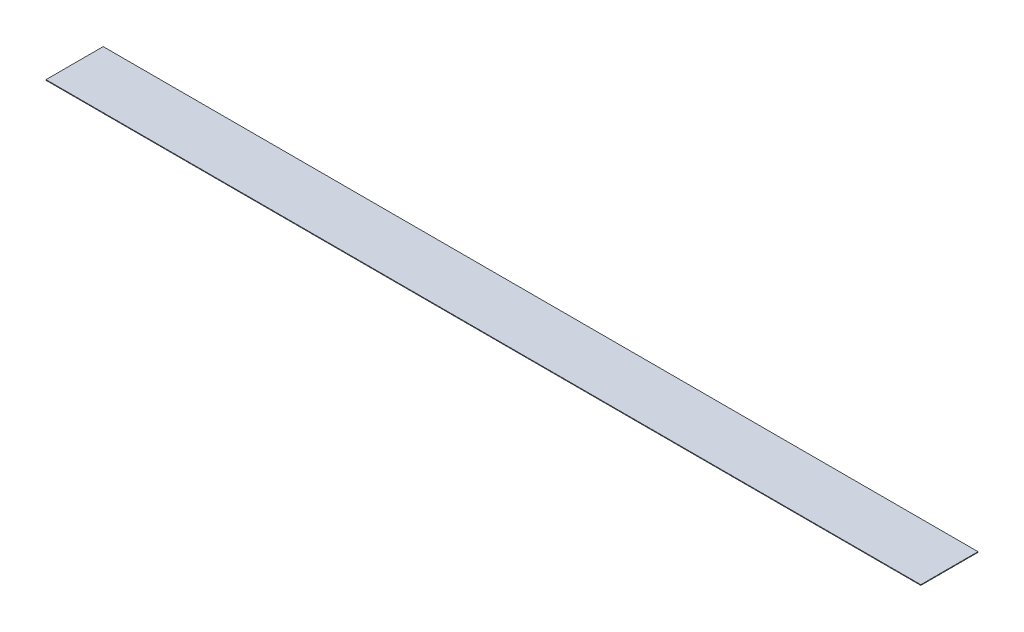
ISO-10303-21;
HEADER;
FILE_DESCRIPTION(('STEP AP214'),'2;1');
FILE_NAME('part.step','',(''),(''),'','','');
FILE_SCHEMA(('AUTOMOTIVE_DESIGN { 1 0 10303 214 1 1 1 1 }'));
ENDSEC;
DATA;
#1=APPLICATION_CONTEXT('core data for automotive mechanical design processes');
#2=APPLICATION_PROTOCOL_DEFINITION('international standard','automotive_design',2000,#1);
#3=PRODUCT_CONTEXT('',#1,'mechanical');
#4=PRODUCT('Part','Part','',(#3));
#5=PRODUCT_RELATED_PRODUCT_CATEGORY('part','',(#4));
#6=PRODUCT_DEFINITION_FORMATION('','',#4);
#7=PRODUCT_DEFINITION_CONTEXT('part definition',#1,'design');
#8=PRODUCT_DEFINITION('design','',#6,#7);
#9=PRODUCT_DEFINITION_SHAPE('','',#8);
#10=(LENGTH_UNIT() NAMED_UNIT(*) SI_UNIT(.MILLI.,.METRE.));
#11=(NAMED_UNIT(*) PLANE_ANGLE_UNIT() SI_UNIT($,.RADIAN.));
#12=(NAMED_UNIT(*) SI_UNIT($,.STERADIAN.) SOLID_ANGLE_UNIT());
#13=UNCERTAINTY_MEASURE_WITH_UNIT(LENGTH_MEASURE(1.E-05),#10,'distance_accuracy_value','');
#14=(GEOMETRIC_REPRESENTATION_CONTEXT(3) GLOBAL_UNCERTAINTY_ASSIGNED_CONTEXT((#13)) GLOBAL_UNIT_ASSIGNED_CONTEXT((#10,
#11,#12)) REPRESENTATION_CONTEXT('',''));
#15=CARTESIAN_POINT('',(0.,0.,0.));
#16=DIRECTION('',(0.,0.,1.));
#17=DIRECTION('',(1.,0.,0.));
#18=AXIS2_PLACEMENT_3D('',#15,#16,#17);
#19=CARTESIAN_POINT('',(0.,0.762,-34.78));
#20=DIRECTION('',(1.,0.,0.));
#21=DIRECTION('',(0.,0.,-1.));
#22=AXIS2_PLACEMENT_3D('',#19,#20,#21);
#23=PLANE('',#22);
#24=DIRECTION('',(0.,0.,1.));
#25=VECTOR('',#24,1.);
#26=CARTESIAN_POINT('',(0.,0.,-34.78));
#27=LINE('',#26,#25);
#28=CARTESIAN_POINT('',(0.,0.,-34.78));
#29=VERTEX_POINT('',#28);
#30=CARTESIAN_POINT('',(0.,0.,34.78));
#31=VERTEX_POINT('',#30);
#32=EDGE_CURVE('E74',#29,#31,#27,.T.);
#33=ORIENTED_EDGE('',*,*,#32,.T.);
#34=DIRECTION('',(0.,-1.,0.));
#35=VECTOR('',#34,1.);
#36=CARTESIAN_POINT('',(0.,0.762,34.78));
#37=LINE('',#36,#35);
#38=CARTESIAN_POINT('',(0.,0.762,34.78));
#39=VERTEX_POINT('',#38);
#40=EDGE_CURVE('E11',#39,#31,#37,.T.);
#41=ORIENTED_EDGE('',*,*,#40,.F.);
#42=DIRECTION('',(0.,0.,1.));
#43=VECTOR('',#42,1.);
#44=CARTESIAN_POINT('',(0.,0.762,-34.78));
#45=LINE('',#44,#43);
#46=CARTESIAN_POINT('',(0.,0.762,-34.78));
#47=VERTEX_POINT('',#46);
#48=EDGE_CURVE('E92',#47,#39,#45,.T.);
#49=ORIENTED_EDGE('',*,*,#48,.F.);
#50=DIRECTION('',(0.,-1.,0.));
#51=VECTOR('',#50,1.);
#52=CARTESIAN_POINT('',(0.,0.762,-34.78));
#53=LINE('',#52,#51);
#54=EDGE_CURVE('E86',#47,#29,#53,.T.);
#55=ORIENTED_EDGE('',*,*,#54,.T.);
#56=EDGE_LOOP('',(#33,#41,#49,#55));
#57=FACE_BOUND('',#56,.T.);
#58=ADVANCED_FACE('F30',(#57),#23,.F.);
#59=CARTESIAN_POINT('',(0.,0.762,34.78));
#60=DIRECTION('',(0.,0.,-1.));
#61=DIRECTION('',(-1.,0.,0.));
#62=AXIS2_PLACEMENT_3D('',#59,#60,#61);
#63=PLANE('',#62);
#64=DIRECTION('',(1.,0.,0.));
#65=VECTOR('',#64,1.);
#66=CARTESIAN_POINT('',(0.,0.,34.78));
#67=LINE('',#66,#65);
#68=CARTESIAN_POINT('',(1064.,0.,34.78));
#69=VERTEX_POINT('',#68);
#70=EDGE_CURVE('E70',#31,#69,#67,.T.);
#71=ORIENTED_EDGE('',*,*,#70,.T.);
#72=DIRECTION('',(0.,-1.,0.));
#73=VECTOR('',#72,1.);
#74=CARTESIAN_POINT('',(1064.,0.762,34.78));
#75=LINE('',#74,#73);
#76=CARTESIAN_POINT('',(1064.,0.762,34.78));
#77=VERTEX_POINT('',#76);
#78=EDGE_CURVE('E37',#77,#69,#75,.T.);
#79=ORIENTED_EDGE('',*,*,#78,.F.);
#80=DIRECTION('',(1.,0.,0.));
#81=VECTOR('',#80,1.);
#82=CARTESIAN_POINT('',(0.,0.762,34.78));
#83=LINE('',#82,#81);
#84=EDGE_CURVE('E82',#39,#77,#83,.T.);
#85=ORIENTED_EDGE('',*,*,#84,.F.);
#86=ORIENTED_EDGE('',*,*,#40,.T.);
#87=EDGE_LOOP('',(#71,#79,#85,#86));
#88=FACE_BOUND('',#87,.T.);
#89=ADVANCED_FACE('F81',(#88),#63,.F.);
#90=CARTESIAN_POINT('',(1064.,0.762,-34.78));
#91=DIRECTION('',(-1.,0.,0.));
#92=DIRECTION('',(0.,0.,1.));
#93=AXIS2_PLACEMENT_3D('',#90,#91,#92);
#94=PLANE('',#93);
#95=DIRECTION('',(0.,0.,-1.));
#96=VECTOR('',#95,1.);
#97=CARTESIAN_POINT('',(1064.,0.,-34.78));
#98=LINE('',#97,#96);
#99=CARTESIAN_POINT('',(1064.,0.,-34.78));
#100=VERTEX_POINT('',#99);
#101=EDGE_CURVE('E75',#69,#100,#98,.T.);
#102=ORIENTED_EDGE('',*,*,#101,.T.);
#103=DIRECTION('',(0.,-1.,0.));
#104=VECTOR('',#103,1.);
#105=CARTESIAN_POINT('',(1064.,0.762,-34.78));
#106=LINE('',#105,#104);
#107=CARTESIAN_POINT('',(1064.,0.762,-34.78));
#108=VERTEX_POINT('',#107);
#109=EDGE_CURVE('E98',#108,#100,#106,.T.);
#110=ORIENTED_EDGE('',*,*,#109,.F.);
#111=DIRECTION('',(0.,0.,-1.));
#112=VECTOR('',#111,1.);
#113=CARTESIAN_POINT('',(1064.,0.762,-34.78));
#114=LINE('',#113,#112);
#115=EDGE_CURVE('E49',#77,#108,#114,.T.);
#116=ORIENTED_EDGE('',*,*,#115,.F.);
#117=ORIENTED_EDGE('',*,*,#78,.T.);
#118=EDGE_LOOP('',(#102,#110,#116,#117));
#119=FACE_BOUND('',#118,.T.);
#120=ADVANCED_FACE('F101',(#119),#94,.F.);
#121=CARTESIAN_POINT('',(0.,0.762,-34.78));
#122=DIRECTION('',(0.,0.,1.));
#123=DIRECTION('',(1.,0.,0.));
#124=AXIS2_PLACEMENT_3D('',#121,#122,#123);
#125=PLANE('',#124);
#126=DIRECTION('',(-1.,0.,0.));
#127=VECTOR('',#126,1.);
#128=CARTESIAN_POINT('',(0.,0.,-34.78));
#129=LINE('',#128,#127);
#130=EDGE_CURVE('E90',#100,#29,#129,.T.);
#131=ORIENTED_EDGE('',*,*,#130,.T.);
#132=ORIENTED_EDGE('',*,*,#54,.F.);
#133=DIRECTION('',(-1.,0.,0.));
#134=VECTOR('',#133,1.);
#135=CARTESIAN_POINT('',(0.,0.762,-34.78));
#136=LINE('',#135,#134);
#137=EDGE_CURVE('E44',#108,#47,#136,.T.);
#138=ORIENTED_EDGE('',*,*,#137,.F.);
#139=ORIENTED_EDGE('',*,*,#109,.T.);
#140=EDGE_LOOP('',(#131,#132,#138,#139));
#141=FACE_BOUND('',#140,.T.);
#142=ADVANCED_FACE('F103',(#141),#125,.F.);
#143=CARTESIAN_POINT('',(0.,0.762,34.78));
#144=DIRECTION('',(0.,1.,0.));
#145=DIRECTION('',(0.,0.,1.));
#146=AXIS2_PLACEMENT_3D('',#143,#144,#145);
#147=PLANE('',#146);
#148=ORIENTED_EDGE('',*,*,#48,.T.);
#149=ORIENTED_EDGE('',*,*,#84,.T.);
#150=ORIENTED_EDGE('',*,*,#115,.T.);
#151=ORIENTED_EDGE('',*,*,#137,.T.);
#152=EDGE_LOOP('',(#148,#149,#150,#151));
#153=FACE_BOUND('',#152,.T.);
#154=ADVANCED_FACE('F104',(#153),#147,.T.);
#155=CARTESIAN_POINT('',(0.,0.,34.78));
#156=DIRECTION('',(0.,1.,0.));
#157=DIRECTION('',(0.,0.,1.));
#158=AXIS2_PLACEMENT_3D('',#155,#156,#157);
#159=PLANE('',#158);
#160=ORIENTED_EDGE('',*,*,#32,.F.);
#161=ORIENTED_EDGE('',*,*,#130,.F.);
#162=ORIENTED_EDGE('',*,*,#101,.F.);
#163=ORIENTED_EDGE('',*,*,#70,.F.);
#164=EDGE_LOOP('',(#160,#161,#162,#163));
#165=FACE_BOUND('',#164,.T.);
#166=ADVANCED_FACE('F71',(#165),#159,.F.);
#167=CLOSED_SHELL('',(#58,#89,#120,#142,#154,#166));
#168=MANIFOLD_SOLID_BREP('B2',#167);
#169=ADVANCED_BREP_SHAPE_REPRESENTATION('',(#18,#168),#14);
#170=SHAPE_DEFINITION_REPRESENTATION(#9,#169);
ENDSEC;
END-ISO-10303-21;
